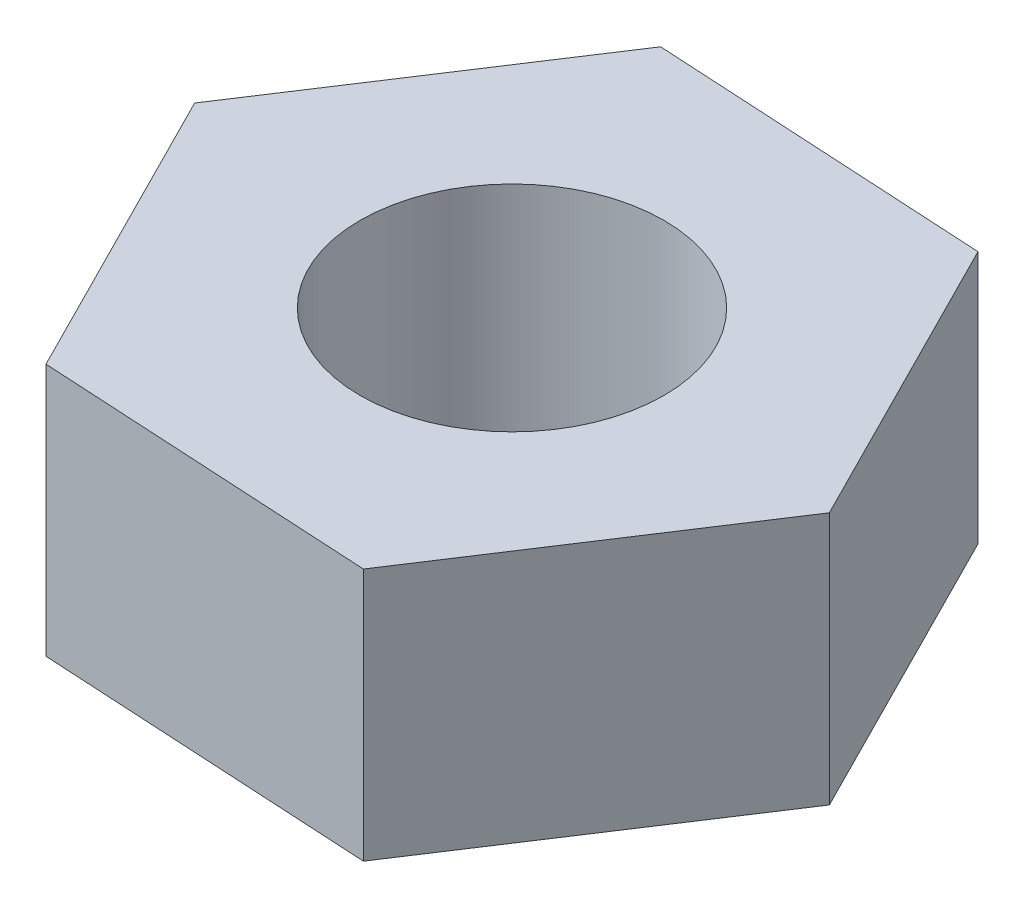
ISO-10303-21;
HEADER;
FILE_DESCRIPTION(('STEP AP214'),'2;1');
FILE_NAME('part.step','',(''),(''),'','','');
FILE_SCHEMA(('AUTOMOTIVE_DESIGN { 1 0 10303 214 1 1 1 1 }'));
ENDSEC;
DATA;
#1=APPLICATION_CONTEXT('core data for automotive mechanical design processes');
#2=APPLICATION_PROTOCOL_DEFINITION('international standard','automotive_design',2000,#1);
#3=PRODUCT_CONTEXT('',#1,'mechanical');
#4=PRODUCT('Part','Part','',(#3));
#5=PRODUCT_RELATED_PRODUCT_CATEGORY('part','',(#4));
#6=PRODUCT_DEFINITION_FORMATION('','',#4);
#7=PRODUCT_DEFINITION_CONTEXT('part definition',#1,'design');
#8=PRODUCT_DEFINITION('design','',#6,#7);
#9=PRODUCT_DEFINITION_SHAPE('','',#8);
#10=(LENGTH_UNIT() NAMED_UNIT(*) SI_UNIT(.MILLI.,.METRE.));
#11=(NAMED_UNIT(*) PLANE_ANGLE_UNIT() SI_UNIT($,.RADIAN.));
#12=(NAMED_UNIT(*) SI_UNIT($,.STERADIAN.) SOLID_ANGLE_UNIT());
#13=UNCERTAINTY_MEASURE_WITH_UNIT(LENGTH_MEASURE(1.E-05),#10,'distance_accuracy_value','');
#14=(GEOMETRIC_REPRESENTATION_CONTEXT(3) GLOBAL_UNCERTAINTY_ASSIGNED_CONTEXT((#13)) GLOBAL_UNIT_ASSIGNED_CONTEXT((#10,
#11,#12)) REPRESENTATION_CONTEXT('',''));
#15=CARTESIAN_POINT('',(0.,0.,0.));
#16=DIRECTION('',(0.,0.,1.));
#17=DIRECTION('',(1.,0.,0.));
#18=AXIS2_PLACEMENT_3D('',#15,#16,#17);
#19=CARTESIAN_POINT('',(-17.1616517318453,2.5,-27.5770496121917));
#20=DIRECTION('',(0.892530967502328,0.,-0.450986110705594));
#21=DIRECTION('',(-0.450986110705594,0.,-0.892530967502328));
#22=AXIS2_PLACEMENT_3D('',#19,#20,#21);
#23=PLANE('',#22);
#24=DIRECTION('',(0.450986110705594,0.,0.892530967502328));
#25=VECTOR('',#24,1.);
#26=CARTESIAN_POINT('',(-17.1616517318453,0.,-27.5770496121917));
#27=LINE('',#26,#25);
#28=CARTESIAN_POINT('',(-3.32088125279071,0.,-0.185260877676591));
#29=VERTEX_POINT('',#28);
#30=CARTESIAN_POINT('',(-1.82088125279068,0.,2.78333708902996));
#31=VERTEX_POINT('',#30);
#32=EDGE_CURVE('E120',#29,#31,#27,.T.);
#33=ORIENTED_EDGE('',*,*,#32,.T.);
#34=DIRECTION('',(0.,-1.,0.));
#35=VECTOR('',#34,1.);
#36=CARTESIAN_POINT('',(-1.82088125279068,2.5,2.78333708902996));
#37=LINE('',#36,#35);
#38=CARTESIAN_POINT('',(-1.82088125279068,2.5,2.78333708902996));
#39=VERTEX_POINT('',#38);
#40=EDGE_CURVE('E11',#39,#31,#37,.T.);
#41=ORIENTED_EDGE('',*,*,#40,.F.);
#42=DIRECTION('',(0.450986110705594,0.,0.892530967502328));
#43=VECTOR('',#42,1.);
#44=CARTESIAN_POINT('',(-17.1616517318453,2.5,-27.5770496121917));
#45=LINE('',#44,#43);
#46=CARTESIAN_POINT('',(-3.32088125279071,2.5,-0.185260877676591));
#47=VERTEX_POINT('',#46);
#48=EDGE_CURVE('E143',#47,#39,#45,.T.);
#49=ORIENTED_EDGE('',*,*,#48,.F.);
#50=DIRECTION('',(0.,-1.,0.));
#51=VECTOR('',#50,1.);
#52=CARTESIAN_POINT('',(-3.32088125279071,2.5,-0.185260877676591));
#53=LINE('',#52,#51);
#54=EDGE_CURVE('E113',#47,#29,#53,.T.);
#55=ORIENTED_EDGE('',*,*,#54,.T.);
#56=EDGE_LOOP('',(#33,#41,#49,#55));
#57=FACE_BOUND('',#56,.T.);
#58=ADVANCED_FACE('F32',(#57),#23,.F.);
#59=CARTESIAN_POINT('',(-71.6763064145919,2.5,-1.11366385464158));
#60=DIRECTION('',(0.0557000551261784,0.,-0.998447546874116));
#61=DIRECTION('',(-0.998447546874116,0.,-0.0557000551261784));
#62=AXIS2_PLACEMENT_3D('',#59,#60,#61);
#63=PLANE('',#62);
#64=DIRECTION('',(0.998447546874116,0.,0.0557000551261784));
#65=VECTOR('',#64,1.);
#66=CARTESIAN_POINT('',(-71.6763064145919,0.,-1.11366385464158));
#67=LINE('',#66,#65);
#68=CARTESIAN_POINT('',(1.50000000000004,0.,2.96859796670654));
#69=VERTEX_POINT('',#68);
#70=EDGE_CURVE('E123',#31,#69,#67,.T.);
#71=ORIENTED_EDGE('',*,*,#70,.T.);
#72=DIRECTION('',(0.,-1.,0.));
#73=VECTOR('',#72,1.);
#74=CARTESIAN_POINT('',(1.50000000000004,2.5,2.96859796670654));
#75=LINE('',#74,#73);
#76=CARTESIAN_POINT('',(1.50000000000004,2.5,2.96859796670654));
#77=VERTEX_POINT('',#76);
#78=EDGE_CURVE('E41',#77,#69,#75,.T.);
#79=ORIENTED_EDGE('',*,*,#78,.F.);
#80=DIRECTION('',(0.998447546874116,0.,0.0557000551261784));
#81=VECTOR('',#80,1.);
#82=CARTESIAN_POINT('',(-71.6763064145919,2.5,-1.11366385464158));
#83=LINE('',#82,#81);
#84=EDGE_CURVE('E86',#39,#77,#83,.T.);
#85=ORIENTED_EDGE('',*,*,#84,.F.);
#86=ORIENTED_EDGE('',*,*,#40,.T.);
#87=EDGE_LOOP('',(#71,#79,#85,#86));
#88=FACE_BOUND('',#87,.T.);
#89=ADVANCED_FACE('F157',(#88),#63,.F.);
#90=CARTESIAN_POINT('',(-19.0905741106375,2.5,34.4426485225698));
#91=DIRECTION('',(-0.83683091237615,0.,-0.547461436168522));
#92=DIRECTION('',(-0.547461436168522,0.,0.83683091237615));
#93=AXIS2_PLACEMENT_3D('',#90,#91,#92);
#94=PLANE('',#93);
#95=DIRECTION('',(0.547461436168522,0.,-0.83683091237615));
#96=VECTOR('',#95,1.);
#97=CARTESIAN_POINT('',(-19.0905741106375,0.,34.4426485225698));
#98=LINE('',#97,#96);
#99=CARTESIAN_POINT('',(3.32088125279071,0.,0.185260877676598));
#100=VERTEX_POINT('',#99);
#101=EDGE_CURVE('E125',#69,#100,#98,.T.);
#102=ORIENTED_EDGE('',*,*,#101,.T.);
#103=DIRECTION('',(0.,-1.,0.));
#104=VECTOR('',#103,1.);
#105=CARTESIAN_POINT('',(3.32088125279071,2.5,0.185260877676598));
#106=LINE('',#105,#104);
#107=CARTESIAN_POINT('',(3.32088125279071,2.5,0.185260877676598));
#108=VERTEX_POINT('',#107);
#109=EDGE_CURVE('E108',#108,#100,#106,.T.);
#110=ORIENTED_EDGE('',*,*,#109,.F.);
#111=DIRECTION('',(0.547461436168522,0.,-0.83683091237615));
#112=VECTOR('',#111,1.);
#113=CARTESIAN_POINT('',(-19.0905741106375,2.5,34.4426485225698));
#114=LINE('',#113,#112);
#115=EDGE_CURVE('E99',#77,#108,#114,.T.);
#116=ORIENTED_EDGE('',*,*,#115,.F.);
#117=ORIENTED_EDGE('',*,*,#78,.T.);
#118=EDGE_LOOP('',(#102,#110,#116,#117));
#119=FACE_BOUND('',#118,.T.);
#120=ADVANCED_FACE('F136',(#119),#94,.F.);
#121=CARTESIAN_POINT('',(-12.019889226264,2.5,-30.1751258235451));
#122=DIRECTION('',(-0.892530967502328,0.,0.450986110705594));
#123=DIRECTION('',(0.450986110705594,0.,0.892530967502328));
#124=AXIS2_PLACEMENT_3D('',#121,#122,#123);
#125=PLANE('',#124);
#126=DIRECTION('',(-0.450986110705594,0.,-0.892530967502328));
#127=VECTOR('',#126,1.);
#128=CARTESIAN_POINT('',(-12.019889226264,0.,-30.1751258235451));
#129=LINE('',#128,#127);
#130=CARTESIAN_POINT('',(1.82088125279068,0.,-2.78333708902996));
#131=VERTEX_POINT('',#130);
#132=EDGE_CURVE('E107',#100,#131,#129,.T.);
#133=ORIENTED_EDGE('',*,*,#132,.T.);
#134=DIRECTION('',(0.,-1.,0.));
#135=VECTOR('',#134,1.);
#136=CARTESIAN_POINT('',(1.82088125279068,2.5,-2.78333708902996));
#137=LINE('',#136,#135);
#138=CARTESIAN_POINT('',(1.82088125279068,2.5,-2.78333708902996));
#139=VERTEX_POINT('',#138);
#140=EDGE_CURVE('E104',#139,#131,#137,.T.);
#141=ORIENTED_EDGE('',*,*,#140,.F.);
#142=DIRECTION('',(-0.450986110705594,0.,-0.892530967502328));
#143=VECTOR('',#142,1.);
#144=CARTESIAN_POINT('',(-12.019889226264,2.5,-30.1751258235451));
#145=LINE('',#144,#143);
#146=EDGE_CURVE('E93',#108,#139,#145,.T.);
#147=ORIENTED_EDGE('',*,*,#146,.F.);
#148=ORIENTED_EDGE('',*,*,#109,.T.);
#149=EDGE_LOOP('',(#133,#141,#147,#148));
#150=FACE_BOUND('',#149,.T.);
#151=ADVANCED_FACE('F105',(#150),#125,.F.);
#152=CARTESIAN_POINT('',(-71.3554251618013,2.5,-6.86559891037807));
#153=DIRECTION('',(-0.0557000551261783,0.,0.998447546874116));
#154=DIRECTION('',(0.998447546874116,0.,0.0557000551261783));
#155=AXIS2_PLACEMENT_3D('',#152,#153,#154);
#156=PLANE('',#155);
#157=DIRECTION('',(-0.998447546874116,0.,-0.0557000551261783));
#158=VECTOR('',#157,1.);
#159=CARTESIAN_POINT('',(-71.3554251618013,0.,-6.86559891037807));
#160=LINE('',#159,#158);
#161=CARTESIAN_POINT('',(-1.50000000000003,0.,-2.96859796670654));
#162=VERTEX_POINT('',#161);
#163=EDGE_CURVE('E72',#131,#162,#160,.T.);
#164=ORIENTED_EDGE('',*,*,#163,.T.);
#165=DIRECTION('',(0.,-1.,0.));
#166=VECTOR('',#165,1.);
#167=CARTESIAN_POINT('',(-1.50000000000003,2.5,-2.96859796670654));
#168=LINE('',#167,#166);
#169=CARTESIAN_POINT('',(-1.50000000000003,2.5,-2.96859796670654));
#170=VERTEX_POINT('',#169);
#171=EDGE_CURVE('E109',#170,#162,#168,.T.);
#172=ORIENTED_EDGE('',*,*,#171,.F.);
#173=DIRECTION('',(-0.998447546874116,0.,-0.0557000551261783));
#174=VECTOR('',#173,1.);
#175=CARTESIAN_POINT('',(-71.3554251618013,2.5,-6.86559891037807));
#176=LINE('',#175,#174);
#177=EDGE_CURVE('E97',#139,#170,#176,.T.);
#178=ORIENTED_EDGE('',*,*,#177,.F.);
#179=ORIENTED_EDGE('',*,*,#140,.T.);
#180=EDGE_LOOP('',(#164,#172,#178,#179));
#181=FACE_BOUND('',#180,.T.);
#182=ADVANCED_FACE('F111',(#181),#156,.F.);
#183=CARTESIAN_POINT('',(0.,2.5,0.));
#184=DIRECTION('',(0.,-1.,0.));
#185=DIRECTION('',(0.,0.,-1.));
#186=AXIS2_PLACEMENT_3D('',#183,#184,#185);
#187=CYLINDRICAL_SURFACE('',#186,1.5);
#188=CARTESIAN_POINT('',(0.,2.5,0.));
#189=DIRECTION('',(0.,1.,0.));
#190=DIRECTION('',(0.,0.,1.));
#191=AXIS2_PLACEMENT_3D('',#188,#189,#190);
#192=CIRCLE('',#191,1.5);
#193=CARTESIAN_POINT('',(0.,2.5,1.5));
#194=VERTEX_POINT('',#193);
#195=EDGE_CURVE('E130',#194,#194,#192,.T.);
#196=ORIENTED_EDGE('',*,*,#195,.T.);
#197=EDGE_LOOP('',(#196));
#198=FACE_BOUND('',#197,.T.);
#199=CARTESIAN_POINT('',(0.,0.,0.));
#200=DIRECTION('',(0.,1.,0.));
#201=DIRECTION('',(0.,0.,1.));
#202=AXIS2_PLACEMENT_3D('',#199,#200,#201);
#203=CIRCLE('',#202,1.5);
#204=CARTESIAN_POINT('',(0.,0.,1.5));
#205=VERTEX_POINT('',#204);
#206=EDGE_CURVE('E117',#205,#205,#203,.T.);
#207=ORIENTED_EDGE('',*,*,#206,.F.);
#208=EDGE_LOOP('',(#207));
#209=FACE_BOUND('',#208,.T.);
#210=ADVANCED_FACE('F34',(#198,#209),#187,.F.);
#211=CARTESIAN_POINT('',(-23.9114553634283,2.5,31.2887896781867));
#212=DIRECTION('',(0.83683091237615,0.,0.547461436168522));
#213=DIRECTION('',(0.547461436168522,0.,-0.83683091237615));
#214=AXIS2_PLACEMENT_3D('',#211,#212,#213);
#215=PLANE('',#214);
#216=DIRECTION('',(-0.547461436168522,0.,0.83683091237615));
#217=VECTOR('',#216,1.);
#218=CARTESIAN_POINT('',(-23.9114553634283,0.,31.2887896781867));
#219=LINE('',#218,#217);
#220=EDGE_CURVE('E78',#162,#29,#219,.T.);
#221=ORIENTED_EDGE('',*,*,#220,.T.);
#222=ORIENTED_EDGE('',*,*,#54,.F.);
#223=DIRECTION('',(-0.547461436168522,0.,0.83683091237615));
#224=VECTOR('',#223,1.);
#225=CARTESIAN_POINT('',(-23.9114553634283,2.5,31.2887896781867));
#226=LINE('',#225,#224);
#227=EDGE_CURVE('E49',#170,#47,#226,.T.);
#228=ORIENTED_EDGE('',*,*,#227,.F.);
#229=ORIENTED_EDGE('',*,*,#171,.T.);
#230=EDGE_LOOP('',(#221,#222,#228,#229));
#231=FACE_BOUND('',#230,.T.);
#232=ADVANCED_FACE('F144',(#231),#215,.F.);
#233=CARTESIAN_POINT('',(-71.7384340028561,2.5,0.));
#234=DIRECTION('',(0.,1.,0.));
#235=DIRECTION('',(0.,0.,1.));
#236=AXIS2_PLACEMENT_3D('',#233,#234,#235);
#237=PLANE('',#236);
#238=ORIENTED_EDGE('',*,*,#195,.F.);
#239=EDGE_LOOP('',(#238));
#240=FACE_BOUND('',#239,.T.);
#241=ORIENTED_EDGE('',*,*,#48,.T.);
#242=ORIENTED_EDGE('',*,*,#84,.T.);
#243=ORIENTED_EDGE('',*,*,#115,.T.);
#244=ORIENTED_EDGE('',*,*,#146,.T.);
#245=ORIENTED_EDGE('',*,*,#177,.T.);
#246=ORIENTED_EDGE('',*,*,#227,.T.);
#247=EDGE_LOOP('',(#241,#242,#243,#244,#245,#246));
#248=FACE_BOUND('',#247,.T.);
#249=ADVANCED_FACE('F95',(#240,#248),#237,.T.);
#250=CARTESIAN_POINT('',(-71.7384340028561,0.,0.));
#251=DIRECTION('',(0.,1.,0.));
#252=DIRECTION('',(0.,0.,1.));
#253=AXIS2_PLACEMENT_3D('',#250,#251,#252);
#254=PLANE('',#253);
#255=ORIENTED_EDGE('',*,*,#206,.T.);
#256=EDGE_LOOP('',(#255));
#257=FACE_BOUND('',#256,.T.);
#258=ORIENTED_EDGE('',*,*,#32,.F.);
#259=ORIENTED_EDGE('',*,*,#220,.F.);
#260=ORIENTED_EDGE('',*,*,#163,.F.);
#261=ORIENTED_EDGE('',*,*,#132,.F.);
#262=ORIENTED_EDGE('',*,*,#101,.F.);
#263=ORIENTED_EDGE('',*,*,#70,.F.);
#264=EDGE_LOOP('',(#258,#259,#260,#261,#262,#263));
#265=FACE_BOUND('',#264,.T.);
#266=ADVANCED_FACE('F139',(#257,#265),#254,.F.);
#267=CLOSED_SHELL('',(#58,#89,#120,#151,#182,#210,#232,#249,#266));
#268=MANIFOLD_SOLID_BREP('B2',#267);
#269=ADVANCED_BREP_SHAPE_REPRESENTATION('',(#18,#268),#14);
#270=SHAPE_DEFINITION_REPRESENTATION(#9,#269);
ENDSEC;
END-ISO-10303-21;
